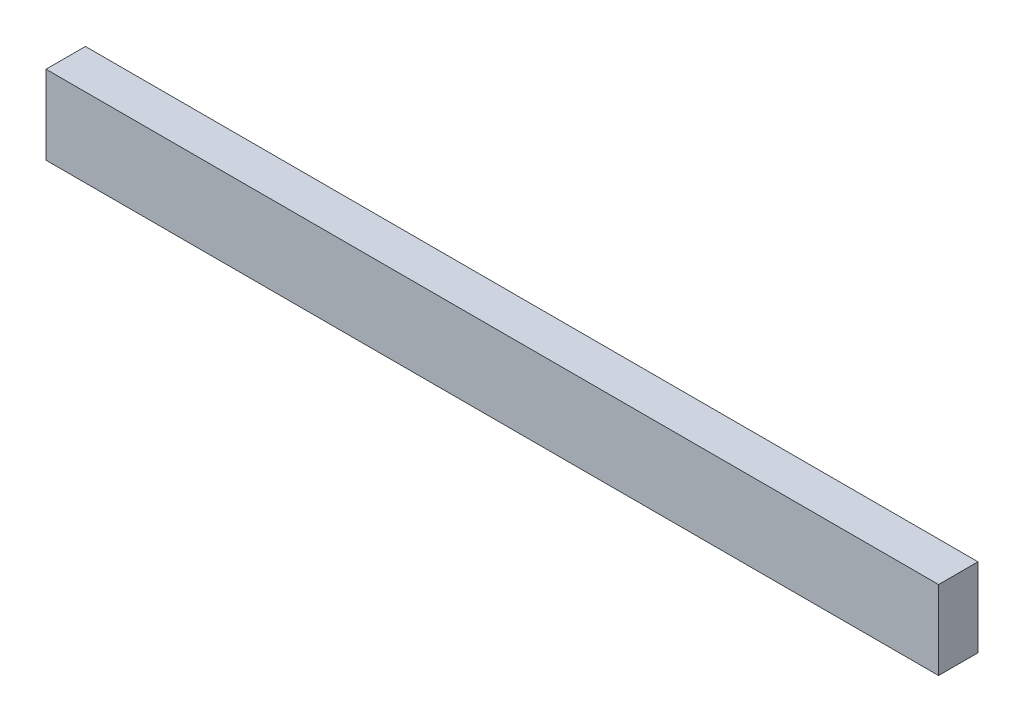
ISO-10303-21;
HEADER;
FILE_DESCRIPTION(('STEP AP214'),'2;1');
FILE_NAME('part.step','',(''),(''),'','','');
FILE_SCHEMA(('AUTOMOTIVE_DESIGN { 1 0 10303 214 1 1 1 1 }'));
ENDSEC;
DATA;
#1=APPLICATION_CONTEXT('core data for automotive mechanical design processes');
#2=APPLICATION_PROTOCOL_DEFINITION('international standard','automotive_design',2000,#1);
#3=PRODUCT_CONTEXT('',#1,'mechanical');
#4=PRODUCT('Part','Part','',(#3));
#5=PRODUCT_RELATED_PRODUCT_CATEGORY('part','',(#4));
#6=PRODUCT_DEFINITION_FORMATION('','',#4);
#7=PRODUCT_DEFINITION_CONTEXT('part definition',#1,'design');
#8=PRODUCT_DEFINITION('design','',#6,#7);
#9=PRODUCT_DEFINITION_SHAPE('','',#8);
#10=(LENGTH_UNIT() NAMED_UNIT(*) SI_UNIT(.MILLI.,.METRE.));
#11=(NAMED_UNIT(*) PLANE_ANGLE_UNIT() SI_UNIT($,.RADIAN.));
#12=(NAMED_UNIT(*) SI_UNIT($,.STERADIAN.) SOLID_ANGLE_UNIT());
#13=UNCERTAINTY_MEASURE_WITH_UNIT(LENGTH_MEASURE(1.E-05),#10,'distance_accuracy_value','');
#14=(GEOMETRIC_REPRESENTATION_CONTEXT(3) GLOBAL_UNCERTAINTY_ASSIGNED_CONTEXT((#13)) GLOBAL_UNIT_ASSIGNED_CONTEXT((#10,
#11,#12)) REPRESENTATION_CONTEXT('',''));
#15=CARTESIAN_POINT('',(0.,0.,0.));
#16=DIRECTION('',(0.,0.,1.));
#17=DIRECTION('',(1.,0.,0.));
#18=AXIS2_PLACEMENT_3D('',#15,#16,#17);
#19=CARTESIAN_POINT('',(-174.239788947368,30.7217678947369,19.05));
#20=DIRECTION('',(1.,0.,0.));
#21=DIRECTION('',(0.,0.,-1.));
#22=AXIS2_PLACEMENT_3D('',#19,#20,#21);
#23=PLANE('',#22);
#24=DIRECTION('',(0.,-1.,0.));
#25=VECTOR('',#24,1.);
#26=CARTESIAN_POINT('',(-174.239788947368,30.7217678947369,0.));
#27=LINE('',#26,#25);
#28=CARTESIAN_POINT('',(-174.239788947368,30.7217678947369,0.));
#29=VERTEX_POINT('',#28);
#30=CARTESIAN_POINT('',(-174.239788947368,-7.37823210526313,0.));
#31=VERTEX_POINT('',#30);
#32=EDGE_CURVE('E107',#29,#31,#27,.T.);
#33=ORIENTED_EDGE('',*,*,#32,.T.);
#34=DIRECTION('',(0.,0.,-1.));
#35=VECTOR('',#34,1.);
#36=CARTESIAN_POINT('',(-174.239788947368,-7.37823210526313,19.05));
#37=LINE('',#36,#35);
#38=CARTESIAN_POINT('',(-174.239788947368,-7.37823210526313,19.05));
#39=VERTEX_POINT('',#38);
#40=EDGE_CURVE('E11',#39,#31,#37,.T.);
#41=ORIENTED_EDGE('',*,*,#40,.F.);
#42=DIRECTION('',(0.,-1.,0.));
#43=VECTOR('',#42,1.);
#44=CARTESIAN_POINT('',(-174.239788947368,30.7217678947369,19.05));
#45=LINE('',#44,#43);
#46=CARTESIAN_POINT('',(-174.239788947368,30.7217678947369,19.05));
#47=VERTEX_POINT('',#46);
#48=EDGE_CURVE('E91',#47,#39,#45,.T.);
#49=ORIENTED_EDGE('',*,*,#48,.F.);
#50=DIRECTION('',(0.,0.,-1.));
#51=VECTOR('',#50,1.);
#52=CARTESIAN_POINT('',(-174.239788947368,30.7217678947369,19.05));
#53=LINE('',#52,#51);
#54=EDGE_CURVE('E103',#47,#29,#53,.T.);
#55=ORIENTED_EDGE('',*,*,#54,.T.);
#56=EDGE_LOOP('',(#33,#41,#49,#55));
#57=FACE_BOUND('',#56,.T.);
#58=ADVANCED_FACE('F39',(#57),#23,.F.);
#59=CARTESIAN_POINT('',(-174.239788947368,-7.37823210526313,19.05));
#60=DIRECTION('',(0.,1.,0.));
#61=DIRECTION('',(0.,0.,1.));
#62=AXIS2_PLACEMENT_3D('',#59,#60,#61);
#63=PLANE('',#62);
#64=DIRECTION('',(1.,0.,0.));
#65=VECTOR('',#64,1.);
#66=CARTESIAN_POINT('',(-174.239788947368,-7.37823210526313,0.));
#67=LINE('',#66,#65);
#68=CARTESIAN_POINT('',(257.103011052632,-7.37823210526313,0.));
#69=VERTEX_POINT('',#68);
#70=EDGE_CURVE('E96',#31,#69,#67,.T.);
#71=ORIENTED_EDGE('',*,*,#70,.T.);
#72=DIRECTION('',(0.,0.,-1.));
#73=VECTOR('',#72,1.);
#74=CARTESIAN_POINT('',(257.103011052632,-7.37823210526313,19.05));
#75=LINE('',#74,#73);
#76=CARTESIAN_POINT('',(257.103011052632,-7.37823210526313,19.05));
#77=VERTEX_POINT('',#76);
#78=EDGE_CURVE('E48',#77,#69,#75,.T.);
#79=ORIENTED_EDGE('',*,*,#78,.F.);
#80=DIRECTION('',(1.,0.,0.));
#81=VECTOR('',#80,1.);
#82=CARTESIAN_POINT('',(-174.239788947368,-7.37823210526313,19.05));
#83=LINE('',#82,#81);
#84=EDGE_CURVE('E86',#39,#77,#83,.T.);
#85=ORIENTED_EDGE('',*,*,#84,.F.);
#86=ORIENTED_EDGE('',*,*,#40,.T.);
#87=EDGE_LOOP('',(#71,#79,#85,#86));
#88=FACE_BOUND('',#87,.T.);
#89=ADVANCED_FACE('F95',(#88),#63,.F.);
#90=CARTESIAN_POINT('',(257.103011052632,30.7217678947369,19.05));
#91=DIRECTION('',(-1.,0.,0.));
#92=DIRECTION('',(0.,0.,1.));
#93=AXIS2_PLACEMENT_3D('',#90,#91,#92);
#94=PLANE('',#93);
#95=DIRECTION('',(0.,1.,0.));
#96=VECTOR('',#95,1.);
#97=CARTESIAN_POINT('',(257.103011052632,30.7217678947369,0.));
#98=LINE('',#97,#96);
#99=CARTESIAN_POINT('',(257.103011052632,30.7217678947369,0.));
#100=VERTEX_POINT('',#99);
#101=EDGE_CURVE('E73',#69,#100,#98,.T.);
#102=ORIENTED_EDGE('',*,*,#101,.T.);
#103=DIRECTION('',(0.,0.,-1.));
#104=VECTOR('',#103,1.);
#105=CARTESIAN_POINT('',(257.103011052632,30.7217678947369,19.05));
#106=LINE('',#105,#104);
#107=CARTESIAN_POINT('',(257.103011052632,30.7217678947369,19.05));
#108=VERTEX_POINT('',#107);
#109=EDGE_CURVE('E98',#108,#100,#106,.T.);
#110=ORIENTED_EDGE('',*,*,#109,.F.);
#111=DIRECTION('',(0.,1.,0.));
#112=VECTOR('',#111,1.);
#113=CARTESIAN_POINT('',(257.103011052632,30.7217678947369,19.05));
#114=LINE('',#113,#112);
#115=EDGE_CURVE('E89',#77,#108,#114,.T.);
#116=ORIENTED_EDGE('',*,*,#115,.F.);
#117=ORIENTED_EDGE('',*,*,#78,.T.);
#118=EDGE_LOOP('',(#102,#110,#116,#117));
#119=FACE_BOUND('',#118,.T.);
#120=ADVANCED_FACE('F99',(#119),#94,.F.);
#121=CARTESIAN_POINT('',(-174.239788947368,30.7217678947369,19.05));
#122=DIRECTION('',(0.,-1.,0.));
#123=DIRECTION('',(0.,0.,-1.));
#124=AXIS2_PLACEMENT_3D('',#121,#122,#123);
#125=PLANE('',#124);
#126=DIRECTION('',(-1.,0.,0.));
#127=VECTOR('',#126,1.);
#128=CARTESIAN_POINT('',(-174.239788947368,30.7217678947369,0.));
#129=LINE('',#128,#127);
#130=EDGE_CURVE('E79',#100,#29,#129,.T.);
#131=ORIENTED_EDGE('',*,*,#130,.T.);
#132=ORIENTED_EDGE('',*,*,#54,.F.);
#133=DIRECTION('',(-1.,0.,0.));
#134=VECTOR('',#133,1.);
#135=CARTESIAN_POINT('',(-174.239788947368,30.7217678947369,19.05));
#136=LINE('',#135,#134);
#137=EDGE_CURVE('E56',#108,#47,#136,.T.);
#138=ORIENTED_EDGE('',*,*,#137,.F.);
#139=ORIENTED_EDGE('',*,*,#109,.T.);
#140=EDGE_LOOP('',(#131,#132,#138,#139));
#141=FACE_BOUND('',#140,.T.);
#142=ADVANCED_FACE('F120',(#141),#125,.F.);
#143=CARTESIAN_POINT('',(0.,0.,19.05));
#144=DIRECTION('',(0.,0.,1.));
#145=DIRECTION('',(1.,0.,0.));
#146=AXIS2_PLACEMENT_3D('',#143,#144,#145);
#147=PLANE('',#146);
#148=ORIENTED_EDGE('',*,*,#48,.T.);
#149=ORIENTED_EDGE('',*,*,#84,.T.);
#150=ORIENTED_EDGE('',*,*,#115,.T.);
#151=ORIENTED_EDGE('',*,*,#137,.T.);
#152=EDGE_LOOP('',(#148,#149,#150,#151));
#153=FACE_BOUND('',#152,.T.);
#154=ADVANCED_FACE('F87',(#153),#147,.T.);
#155=CARTESIAN_POINT('',(0.,0.,0.));
#156=DIRECTION('',(0.,0.,1.));
#157=DIRECTION('',(1.,0.,0.));
#158=AXIS2_PLACEMENT_3D('',#155,#156,#157);
#159=PLANE('',#158);
#160=ORIENTED_EDGE('',*,*,#32,.F.);
#161=ORIENTED_EDGE('',*,*,#130,.F.);
#162=ORIENTED_EDGE('',*,*,#101,.F.);
#163=ORIENTED_EDGE('',*,*,#70,.F.);
#164=EDGE_LOOP('',(#160,#161,#162,#163));
#165=FACE_BOUND('',#164,.T.);
#166=ADVANCED_FACE('F123',(#165),#159,.F.);
#167=CLOSED_SHELL('',(#58,#89,#120,#142,#154,#166));
#168=MANIFOLD_SOLID_BREP('B2',#167);
#169=ADVANCED_BREP_SHAPE_REPRESENTATION('',(#18,#168),#14);
#170=SHAPE_DEFINITION_REPRESENTATION(#9,#169);
ENDSEC;
END-ISO-10303-21;
